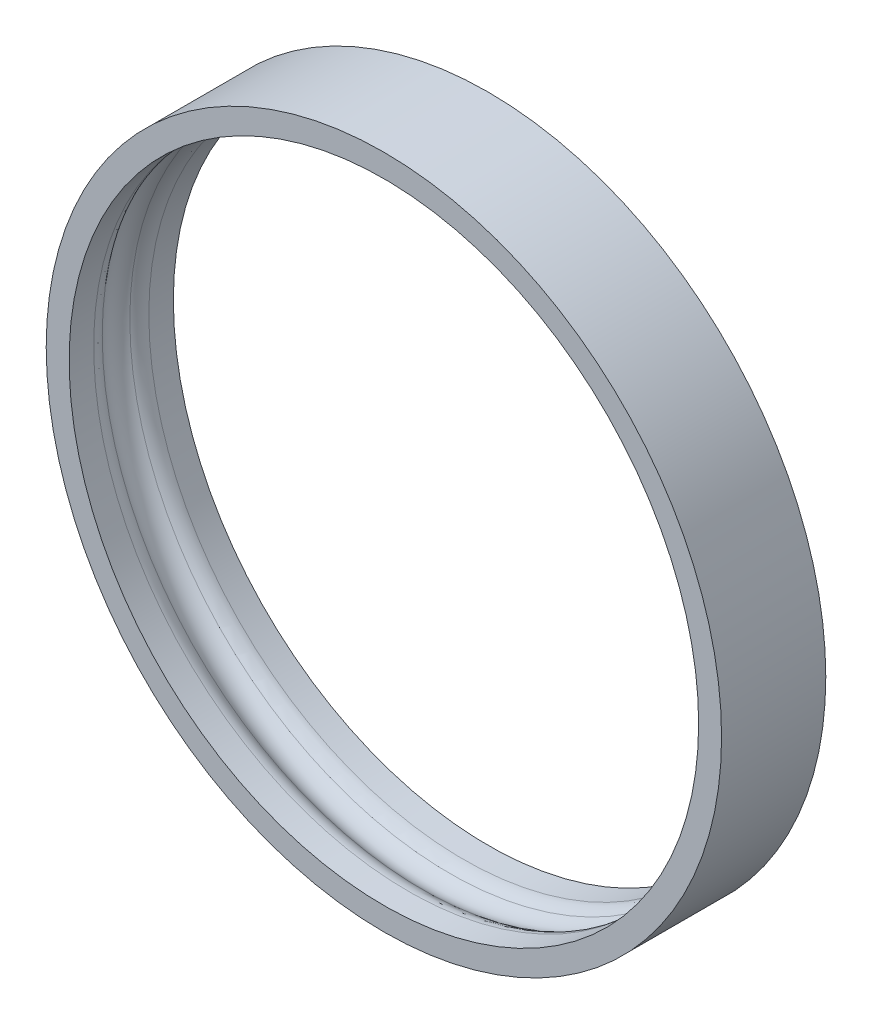
ISO-10303-21;
HEADER;
FILE_DESCRIPTION(('STEP AP214'),'2;1');
FILE_NAME('part.step','',(''),(''),'','','');
FILE_SCHEMA(('AUTOMOTIVE_DESIGN { 1 0 10303 214 1 1 1 1 }'));
ENDSEC;
DATA;
#1=APPLICATION_CONTEXT('core data for automotive mechanical design processes');
#2=APPLICATION_PROTOCOL_DEFINITION('international standard','automotive_design',2000,#1);
#3=PRODUCT_CONTEXT('',#1,'mechanical');
#4=PRODUCT('Part','Part','',(#3));
#5=PRODUCT_RELATED_PRODUCT_CATEGORY('part','',(#4));
#6=PRODUCT_DEFINITION_FORMATION('','',#4);
#7=PRODUCT_DEFINITION_CONTEXT('part definition',#1,'design');
#8=PRODUCT_DEFINITION('design','',#6,#7);
#9=PRODUCT_DEFINITION_SHAPE('','',#8);
#10=(LENGTH_UNIT() NAMED_UNIT(*) SI_UNIT(.MILLI.,.METRE.));
#11=(NAMED_UNIT(*) PLANE_ANGLE_UNIT() SI_UNIT($,.RADIAN.));
#12=(NAMED_UNIT(*) SI_UNIT($,.STERADIAN.) SOLID_ANGLE_UNIT());
#13=UNCERTAINTY_MEASURE_WITH_UNIT(LENGTH_MEASURE(1.E-05),#10,'distance_accuracy_value','');
#14=(GEOMETRIC_REPRESENTATION_CONTEXT(3) GLOBAL_UNCERTAINTY_ASSIGNED_CONTEXT((#13)) GLOBAL_UNIT_ASSIGNED_CONTEXT((#10,
#11,#12)) REPRESENTATION_CONTEXT('',''));
#15=CARTESIAN_POINT('',(0.,0.,0.));
#16=DIRECTION('',(0.,0.,1.));
#17=DIRECTION('',(1.,0.,0.));
#18=AXIS2_PLACEMENT_3D('',#15,#16,#17);
#19=CARTESIAN_POINT('',(0.,0.,2.5));
#20=DIRECTION('',(0.,0.,-1.));
#21=DIRECTION('',(-1.,0.,0.));
#22=AXIS2_PLACEMENT_3D('',#19,#20,#21);
#23=CYLINDRICAL_SURFACE('',#22,15.1);
#24=CARTESIAN_POINT('',(0.,0.,1.32287565553229));
#25=DIRECTION('',(0.,0.,1.));
#26=DIRECTION('',(1.,0.,0.));
#27=AXIS2_PLACEMENT_3D('',#24,#25,#26);
#28=CIRCLE('',#27,15.1);
#29=CARTESIAN_POINT('',(15.1,0.,1.32287565553229));
#30=VERTEX_POINT('',#29);
#31=EDGE_CURVE('E50',#30,#30,#28,.F.);
#32=ORIENTED_EDGE('',*,*,#31,.T.);
#33=EDGE_LOOP('',(#32));
#34=FACE_BOUND('',#33,.T.);
#35=CARTESIAN_POINT('',(0.,0.,2.5));
#36=DIRECTION('',(0.,0.,1.));
#37=DIRECTION('',(1.,0.,0.));
#38=AXIS2_PLACEMENT_3D('',#35,#36,#37);
#39=CIRCLE('',#38,15.1);
#40=CARTESIAN_POINT('',(15.1,0.,2.5));
#41=VERTEX_POINT('',#40);
#42=EDGE_CURVE('E59',#41,#41,#39,.T.);
#43=ORIENTED_EDGE('',*,*,#42,.T.);
#44=EDGE_LOOP('',(#43));
#45=FACE_BOUND('',#44,.T.);
#46=ADVANCED_FACE('F35',(#34,#45),#23,.F.);
#47=CARTESIAN_POINT('',(0.,0.,-1.32287565553229));
#48=DIRECTION('',(0.,0.,-1.));
#49=DIRECTION('',(-1.,0.,0.));
#50=AXIS2_PLACEMENT_3D('',#47,#48,#49);
#51=CIRCLE('',#50,15.1);
#52=CARTESIAN_POINT('',(-15.1,0.,-1.32287565553229));
#53=VERTEX_POINT('',#52);
#54=EDGE_CURVE('E10',#53,#53,#51,.F.);
#55=ORIENTED_EDGE('',*,*,#54,.T.);
#56=EDGE_LOOP('',(#55));
#57=FACE_BOUND('',#56,.T.);
#58=CARTESIAN_POINT('',(0.,0.,-2.5));
#59=DIRECTION('',(0.,0.,1.));
#60=DIRECTION('',(1.,0.,0.));
#61=AXIS2_PLACEMENT_3D('',#58,#59,#60);
#62=CIRCLE('',#61,15.1);
#63=CARTESIAN_POINT('',(15.1,0.,-2.5));
#64=VERTEX_POINT('',#63);
#65=EDGE_CURVE('E62',#64,#64,#62,.T.);
#66=ORIENTED_EDGE('',*,*,#65,.F.);
#67=EDGE_LOOP('',(#66));
#68=FACE_BOUND('',#67,.T.);
#69=ADVANCED_FACE('F72',(#57,#68),#23,.F.);
#70=CARTESIAN_POINT('',(0.,0.,2.5));
#71=DIRECTION('',(0.,0.,1.));
#72=DIRECTION('',(1.,0.,0.));
#73=AXIS2_PLACEMENT_3D('',#70,#71,#72);
#74=PLANE('',#73);
#75=CARTESIAN_POINT('',(0.,0.,2.5));
#76=DIRECTION('',(0.,0.,1.));
#77=DIRECTION('',(1.,0.,0.));
#78=AXIS2_PLACEMENT_3D('',#75,#76,#77);
#79=CIRCLE('',#78,16.2);
#80=CARTESIAN_POINT('',(16.2,0.,2.5));
#81=VERTEX_POINT('',#80);
#82=EDGE_CURVE('E55',#81,#81,#79,.T.);
#83=ORIENTED_EDGE('',*,*,#82,.T.);
#84=EDGE_LOOP('',(#83));
#85=FACE_BOUND('',#84,.T.);
#86=ORIENTED_EDGE('',*,*,#42,.F.);
#87=EDGE_LOOP('',(#86));
#88=FACE_BOUND('',#87,.T.);
#89=ADVANCED_FACE('F69',(#85,#88),#74,.T.);
#90=CARTESIAN_POINT('',(0.,0.,-2.5));
#91=DIRECTION('',(0.,0.,1.));
#92=DIRECTION('',(1.,0.,0.));
#93=AXIS2_PLACEMENT_3D('',#90,#91,#92);
#94=PLANE('',#93);
#95=CARTESIAN_POINT('',(0.,0.,-2.5));
#96=DIRECTION('',(0.,0.,1.));
#97=DIRECTION('',(1.,0.,0.));
#98=AXIS2_PLACEMENT_3D('',#95,#96,#97);
#99=CIRCLE('',#98,16.2);
#100=CARTESIAN_POINT('',(16.2,0.,-2.5));
#101=VERTEX_POINT('',#100);
#102=EDGE_CURVE('E56',#101,#101,#99,.T.);
#103=ORIENTED_EDGE('',*,*,#102,.F.);
#104=EDGE_LOOP('',(#103));
#105=FACE_BOUND('',#104,.T.);
#106=ORIENTED_EDGE('',*,*,#65,.T.);
#107=EDGE_LOOP('',(#106));
#108=FACE_BOUND('',#107,.T.);
#109=ADVANCED_FACE('F71',(#105,#108),#94,.F.);
#110=CARTESIAN_POINT('',(0.,0.,2.5));
#111=DIRECTION('',(0.,0.,-1.));
#112=DIRECTION('',(-1.,0.,0.));
#113=AXIS2_PLACEMENT_3D('',#110,#111,#112);
#114=CYLINDRICAL_SURFACE('',#113,16.2);
#115=ORIENTED_EDGE('',*,*,#82,.F.);
#116=EDGE_LOOP('',(#115));
#117=FACE_BOUND('',#116,.T.);
#118=ORIENTED_EDGE('',*,*,#102,.T.);
#119=EDGE_LOOP('',(#118));
#120=FACE_BOUND('',#119,.T.);
#121=ADVANCED_FACE('F79',(#117,#120),#114,.T.);
#122=CARTESIAN_POINT('',(0.,0.,0.));
#123=DIRECTION('',(0.,0.,1.));
#124=DIRECTION('',(1.,0.,0.));
#125=AXIS2_PLACEMENT_3D('',#122,#123,#124);
#126=TOROIDAL_SURFACE('',#125,14.6,1.);
#127=CARTESIAN_POINT('',(0.,0.,0.661437827766109));
#128=DIRECTION('',(0.,0.,-1.));
#129=DIRECTION('',(-1.,0.,0.));
#130=AXIS2_PLACEMENT_3D('',#127,#128,#129);
#131=CIRCLE('',#130,15.35);
#132=CARTESIAN_POINT('',(-15.35,0.,0.661437827766109));
#133=VERTEX_POINT('',#132);
#134=EDGE_CURVE('E42',#133,#133,#131,.F.);
#135=ORIENTED_EDGE('',*,*,#134,.T.);
#136=EDGE_LOOP('',(#135));
#137=FACE_BOUND('',#136,.T.);
#138=CARTESIAN_POINT('',(0.,0.,-0.661437827766144));
#139=DIRECTION('',(0.,0.,1.));
#140=DIRECTION('',(1.,0.,0.));
#141=AXIS2_PLACEMENT_3D('',#138,#139,#140);
#142=CIRCLE('',#141,15.35);
#143=CARTESIAN_POINT('',(15.35,0.,-0.661437827766144));
#144=VERTEX_POINT('',#143);
#145=EDGE_CURVE('E46',#144,#144,#142,.F.);
#146=ORIENTED_EDGE('',*,*,#145,.T.);
#147=EDGE_LOOP('',(#146));
#148=FACE_BOUND('',#147,.T.);
#149=ADVANCED_FACE('F88',(#137,#148),#126,.F.);
#150=CARTESIAN_POINT('',(0.,0.,1.32287565553229));
#151=DIRECTION('',(0.,0.,1.));
#152=DIRECTION('',(1.,0.,0.));
#153=AXIS2_PLACEMENT_3D('',#150,#151,#152);
#154=TOROIDAL_SURFACE('',#153,16.1,1.);
#155=ORIENTED_EDGE('',*,*,#134,.F.);
#156=EDGE_LOOP('',(#155));
#157=FACE_BOUND('',#156,.T.);
#158=ORIENTED_EDGE('',*,*,#31,.F.);
#159=EDGE_LOOP('',(#158));
#160=FACE_BOUND('',#159,.T.);
#161=ADVANCED_FACE('F90',(#157,#160),#154,.T.);
#162=CARTESIAN_POINT('',(0.,0.,-1.32287565553229));
#163=DIRECTION('',(0.,0.,-1.));
#164=DIRECTION('',(-1.,0.,0.));
#165=AXIS2_PLACEMENT_3D('',#162,#163,#164);
#166=TOROIDAL_SURFACE('',#165,16.1,1.);
#167=ORIENTED_EDGE('',*,*,#145,.F.);
#168=EDGE_LOOP('',(#167));
#169=FACE_BOUND('',#168,.T.);
#170=ORIENTED_EDGE('',*,*,#54,.F.);
#171=EDGE_LOOP('',(#170));
#172=FACE_BOUND('',#171,.T.);
#173=ADVANCED_FACE('F37',(#169,#172),#166,.T.);
#174=CLOSED_SHELL('',(#46,#69,#89,#109,#121,#149,#161,#173));
#175=MANIFOLD_SOLID_BREP('B2',#174);
#176=ADVANCED_BREP_SHAPE_REPRESENTATION('',(#18,#175),#14);
#177=SHAPE_DEFINITION_REPRESENTATION(#9,#176);
ENDSEC;
END-ISO-10303-21;
